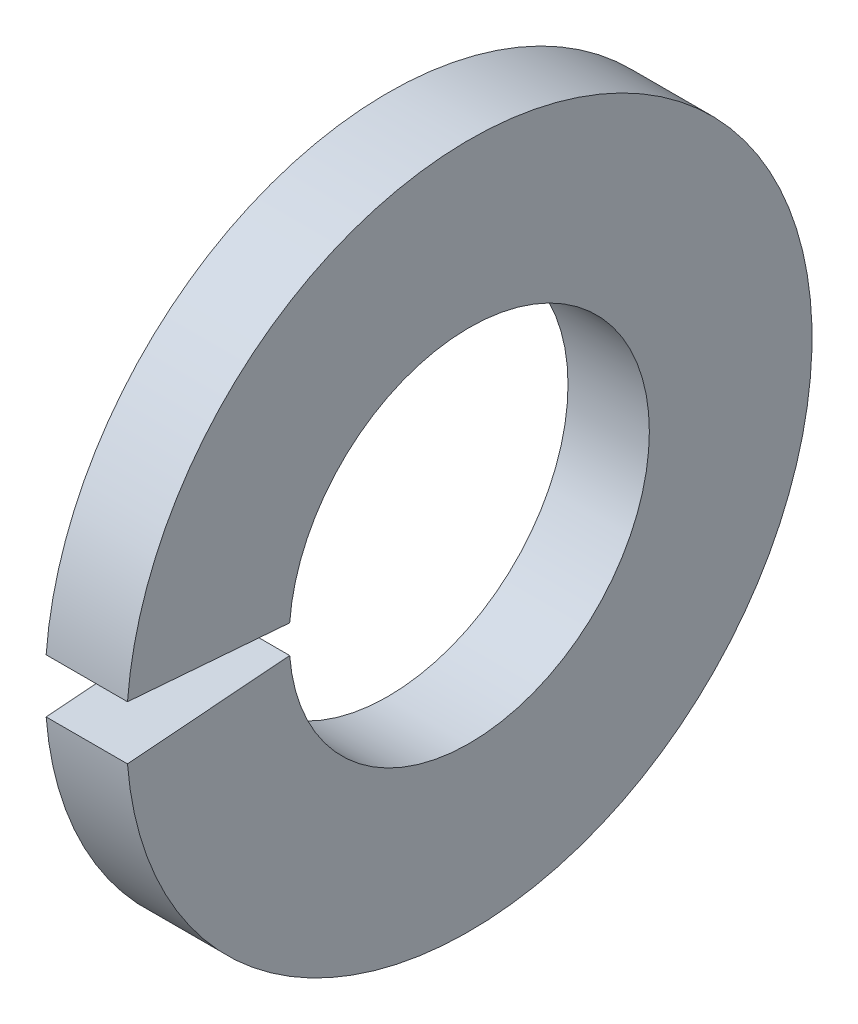
ISO-10303-21;
HEADER;
FILE_DESCRIPTION(('STEP AP214'),'2;1');
FILE_NAME('part.step','',(''),(''),'','','');
FILE_SCHEMA(('AUTOMOTIVE_DESIGN { 1 0 10303 214 1 1 1 1 }'));
ENDSEC;
DATA;
#1=APPLICATION_CONTEXT('core data for automotive mechanical design processes');
#2=APPLICATION_PROTOCOL_DEFINITION('international standard','automotive_design',2000,#1);
#3=PRODUCT_CONTEXT('',#1,'mechanical');
#4=PRODUCT('Part','Part','',(#3));
#5=PRODUCT_RELATED_PRODUCT_CATEGORY('part','',(#4));
#6=PRODUCT_DEFINITION_FORMATION('','',#4);
#7=PRODUCT_DEFINITION_CONTEXT('part definition',#1,'design');
#8=PRODUCT_DEFINITION('design','',#6,#7);
#9=PRODUCT_DEFINITION_SHAPE('','',#8);
#10=(LENGTH_UNIT() NAMED_UNIT(*) SI_UNIT(.MILLI.,.METRE.));
#11=(NAMED_UNIT(*) PLANE_ANGLE_UNIT() SI_UNIT($,.RADIAN.));
#12=(NAMED_UNIT(*) SI_UNIT($,.STERADIAN.) SOLID_ANGLE_UNIT());
#13=UNCERTAINTY_MEASURE_WITH_UNIT(LENGTH_MEASURE(1.E-05),#10,'distance_accuracy_value','');
#14=(GEOMETRIC_REPRESENTATION_CONTEXT(3) GLOBAL_UNCERTAINTY_ASSIGNED_CONTEXT((#13)) GLOBAL_UNIT_ASSIGNED_CONTEXT((#10,
#11,#12)) REPRESENTATION_CONTEXT('',''));
#15=CARTESIAN_POINT('',(0.,0.,0.));
#16=DIRECTION('',(0.,0.,1.));
#17=DIRECTION('',(1.,0.,0.));
#18=AXIS2_PLACEMENT_3D('',#15,#16,#17);
#19=CARTESIAN_POINT('',(-34.9249999999999,0.,0.));
#20=DIRECTION('',(-1.,0.,0.));
#21=DIRECTION('',(0.,0.,1.));
#22=AXIS2_PLACEMENT_3D('',#19,#20,#21);
#23=CYLINDRICAL_SURFACE('',#22,1.55);
#24=CARTESIAN_POINT('',(0.,0.,0.));
#25=DIRECTION('',(-1.,0.,0.));
#26=DIRECTION('',(0.,0.,1.));
#27=AXIS2_PLACEMENT_3D('',#24,#25,#26);
#28=CIRCLE('',#27,1.55);
#29=CARTESIAN_POINT('',(0.,0.121611598378161,1.54522186728635));
#30=VERTEX_POINT('',#29);
#31=CARTESIAN_POINT('',(0.,-0.121611598378161,1.54522186728635));
#32=VERTEX_POINT('',#31);
#33=EDGE_CURVE('E83',#30,#32,#28,.T.);
#34=ORIENTED_EDGE('',*,*,#33,.F.);
#35=DIRECTION('',(-1.,0.,0.));
#36=VECTOR('',#35,1.);
#37=CARTESIAN_POINT('',(-34.9249999999999,0.121611598378161,1.54522186728635));
#38=LINE('',#37,#36);
#39=CARTESIAN_POINT('',(-0.7,0.121611598378161,1.54522186728635));
#40=VERTEX_POINT('',#39);
#41=EDGE_CURVE('E97',#30,#40,#38,.T.);
#42=ORIENTED_EDGE('',*,*,#41,.T.);
#43=CARTESIAN_POINT('',(-0.699999999999999,0.,0.));
#44=DIRECTION('',(-1.,0.,0.));
#45=DIRECTION('',(0.,0.,1.));
#46=AXIS2_PLACEMENT_3D('',#43,#44,#45);
#47=CIRCLE('',#46,1.55);
#48=CARTESIAN_POINT('',(-0.699999999999999,-0.12161159837816,1.54522186728635));
#49=VERTEX_POINT('',#48);
#50=EDGE_CURVE('E85',#40,#49,#47,.T.);
#51=ORIENTED_EDGE('',*,*,#50,.T.);
#52=DIRECTION('',(-1.,0.,0.));
#53=VECTOR('',#52,1.);
#54=CARTESIAN_POINT('',(-34.9249999999999,-0.121611598378161,1.54522186728635));
#55=LINE('',#54,#53);
#56=EDGE_CURVE('E53',#32,#49,#55,.T.);
#57=ORIENTED_EDGE('',*,*,#56,.F.);
#58=EDGE_LOOP('',(#34,#42,#51,#57));
#59=FACE_BOUND('',#58,.T.);
#60=ADVANCED_FACE('F32',(#59),#23,.F.);
#61=CARTESIAN_POINT('',(0.,1.55,0.));
#62=DIRECTION('',(-1.,0.,0.));
#63=DIRECTION('',(0.,0.,1.));
#64=AXIS2_PLACEMENT_3D('',#61,#62,#63);
#65=PLANE('',#64);
#66=CARTESIAN_POINT('',(0.,0.,0.));
#67=DIRECTION('',(-1.,0.,0.));
#68=DIRECTION('',(0.,0.,1.));
#69=AXIS2_PLACEMENT_3D('',#66,#67,#68);
#70=CIRCLE('',#69,2.95);
#71=CARTESIAN_POINT('',(0.,0.231454332397145,2.94090613451273));
#72=VERTEX_POINT('',#71);
#73=CARTESIAN_POINT('',(0.,-0.231454332397145,2.94090613451273));
#74=VERTEX_POINT('',#73);
#75=EDGE_CURVE('E89',#72,#74,#70,.T.);
#76=ORIENTED_EDGE('',*,*,#75,.F.);
#77=DIRECTION('',(0.,0.0784590957278456,0.996917333733128));
#78=VECTOR('',#77,1.);
#79=CARTESIAN_POINT('',(0.,0.,0.));
#80=LINE('',#79,#78);
#81=EDGE_CURVE('E77',#30,#72,#80,.T.);
#82=ORIENTED_EDGE('',*,*,#81,.F.);
#83=ORIENTED_EDGE('',*,*,#33,.T.);
#84=DIRECTION('',(0.,-0.0784590957278456,0.996917333733128));
#85=VECTOR('',#84,1.);
#86=CARTESIAN_POINT('',(0.,0.,0.));
#87=LINE('',#86,#85);
#88=EDGE_CURVE('E69',#32,#74,#87,.T.);
#89=ORIENTED_EDGE('',*,*,#88,.T.);
#90=EDGE_LOOP('',(#76,#82,#83,#89));
#91=FACE_BOUND('',#90,.T.);
#92=ADVANCED_FACE('F88',(#91),#65,.F.);
#93=CARTESIAN_POINT('',(-34.9249999999999,0.,0.));
#94=DIRECTION('',(-1.,0.,0.));
#95=DIRECTION('',(0.,0.,1.));
#96=AXIS2_PLACEMENT_3D('',#93,#94,#95);
#97=CYLINDRICAL_SURFACE('',#96,2.95);
#98=CARTESIAN_POINT('',(-0.699999999999999,0.,0.));
#99=DIRECTION('',(-1.,0.,0.));
#100=DIRECTION('',(0.,0.,1.));
#101=AXIS2_PLACEMENT_3D('',#98,#99,#100);
#102=CIRCLE('',#101,2.95);
#103=CARTESIAN_POINT('',(-0.699999999999999,0.231454332397145,2.94090613451273));
#104=VERTEX_POINT('',#103);
#105=CARTESIAN_POINT('',(-0.7,-0.231454332397145,2.94090613451273));
#106=VERTEX_POINT('',#105);
#107=EDGE_CURVE('E91',#104,#106,#102,.T.);
#108=ORIENTED_EDGE('',*,*,#107,.F.);
#109=DIRECTION('',(-1.,0.,0.));
#110=VECTOR('',#109,1.);
#111=CARTESIAN_POINT('',(-34.9249999999999,0.231454332397145,2.94090613451273));
#112=LINE('',#111,#110);
#113=EDGE_CURVE('E46',#104,#72,#112,.F.);
#114=ORIENTED_EDGE('',*,*,#113,.T.);
#115=ORIENTED_EDGE('',*,*,#75,.T.);
#116=DIRECTION('',(-1.,0.,0.));
#117=VECTOR('',#116,1.);
#118=CARTESIAN_POINT('',(-34.9249999999999,-0.231454332397145,2.94090613451273));
#119=LINE('',#118,#117);
#120=EDGE_CURVE('E72',#106,#74,#119,.F.);
#121=ORIENTED_EDGE('',*,*,#120,.F.);
#122=EDGE_LOOP('',(#108,#114,#115,#121));
#123=FACE_BOUND('',#122,.T.);
#124=ADVANCED_FACE('F104',(#123),#97,.T.);
#125=CARTESIAN_POINT('',(-0.7,2.95,0.));
#126=DIRECTION('',(1.,0.,0.));
#127=DIRECTION('',(0.,0.,-1.));
#128=AXIS2_PLACEMENT_3D('',#125,#126,#127);
#129=PLANE('',#128);
#130=ORIENTED_EDGE('',*,*,#50,.F.);
#131=DIRECTION('',(0.,0.0784590957278456,0.996917333733128));
#132=VECTOR('',#131,1.);
#133=CARTESIAN_POINT('',(-0.7,0.0181596976221725,0.230740835934343));
#134=LINE('',#133,#132);
#135=EDGE_CURVE('E11',#40,#104,#134,.T.);
#136=ORIENTED_EDGE('',*,*,#135,.T.);
#137=ORIENTED_EDGE('',*,*,#107,.T.);
#138=DIRECTION('',(0.,-0.0784590957278456,0.996917333733128));
#139=VECTOR('',#138,1.);
#140=CARTESIAN_POINT('',(-0.7,0.0181596976221725,-0.230740835934343));
#141=LINE('',#140,#139);
#142=EDGE_CURVE('E39',#49,#106,#141,.T.);
#143=ORIENTED_EDGE('',*,*,#142,.F.);
#144=EDGE_LOOP('',(#130,#136,#137,#143));
#145=FACE_BOUND('',#144,.T.);
#146=ADVANCED_FACE('F106',(#145),#129,.F.);
#147=CARTESIAN_POINT('',(-0.7,0.,0.));
#148=DIRECTION('',(0.,0.996917333733128,0.0784590957278456));
#149=DIRECTION('',(0.,-0.0784590957278456,0.996917333733128));
#150=AXIS2_PLACEMENT_3D('',#147,#148,#149);
#151=PLANE('',#150);
#152=ORIENTED_EDGE('',*,*,#56,.T.);
#153=ORIENTED_EDGE('',*,*,#142,.T.);
#154=ORIENTED_EDGE('',*,*,#120,.T.);
#155=ORIENTED_EDGE('',*,*,#88,.F.);
#156=EDGE_LOOP('',(#152,#153,#154,#155));
#157=FACE_BOUND('',#156,.T.);
#158=ADVANCED_FACE('F70',(#157),#151,.T.);
#159=CARTESIAN_POINT('',(-0.7,0.,0.));
#160=DIRECTION('',(0.,0.996917333733128,-0.0784590957278456));
#161=DIRECTION('',(0.,0.0784590957278456,0.996917333733128));
#162=AXIS2_PLACEMENT_3D('',#159,#160,#161);
#163=PLANE('',#162);
#164=ORIENTED_EDGE('',*,*,#81,.T.);
#165=ORIENTED_EDGE('',*,*,#113,.F.);
#166=ORIENTED_EDGE('',*,*,#135,.F.);
#167=ORIENTED_EDGE('',*,*,#41,.F.);
#168=EDGE_LOOP('',(#164,#165,#166,#167));
#169=FACE_BOUND('',#168,.T.);
#170=ADVANCED_FACE('F101',(#169),#163,.F.);
#171=CLOSED_SHELL('',(#60,#92,#124,#146,#158,#170));
#172=MANIFOLD_SOLID_BREP('B2',#171);
#173=ADVANCED_BREP_SHAPE_REPRESENTATION('',(#18,#172),#14);
#174=SHAPE_DEFINITION_REPRESENTATION(#9,#173);
ENDSEC;
END-ISO-10303-21;
